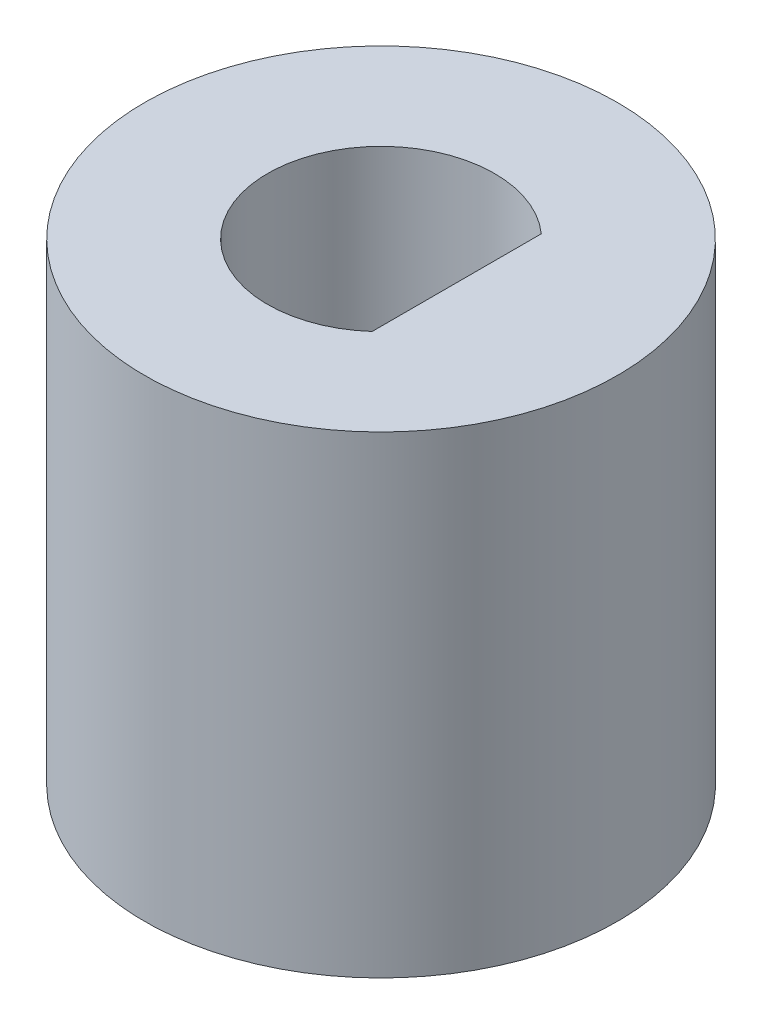
ISO-10303-21;
HEADER;
FILE_DESCRIPTION(('STEP AP214'),'2;1');
FILE_NAME('part.step','',(''),(''),'','','');
FILE_SCHEMA(('AUTOMOTIVE_DESIGN { 1 0 10303 214 1 1 1 1 }'));
ENDSEC;
DATA;
#1=APPLICATION_CONTEXT('core data for automotive mechanical design processes');
#2=APPLICATION_PROTOCOL_DEFINITION('international standard','automotive_design',2000,#1);
#3=PRODUCT_CONTEXT('',#1,'mechanical');
#4=PRODUCT('Part','Part','',(#3));
#5=PRODUCT_RELATED_PRODUCT_CATEGORY('part','',(#4));
#6=PRODUCT_DEFINITION_FORMATION('','',#4);
#7=PRODUCT_DEFINITION_CONTEXT('part definition',#1,'design');
#8=PRODUCT_DEFINITION('design','',#6,#7);
#9=PRODUCT_DEFINITION_SHAPE('','',#8);
#10=(LENGTH_UNIT() NAMED_UNIT(*) SI_UNIT(.MILLI.,.METRE.));
#11=(NAMED_UNIT(*) PLANE_ANGLE_UNIT() SI_UNIT($,.RADIAN.));
#12=(NAMED_UNIT(*) SI_UNIT($,.STERADIAN.) SOLID_ANGLE_UNIT());
#13=UNCERTAINTY_MEASURE_WITH_UNIT(LENGTH_MEASURE(1.E-05),#10,'distance_accuracy_value','');
#14=(GEOMETRIC_REPRESENTATION_CONTEXT(3) GLOBAL_UNCERTAINTY_ASSIGNED_CONTEXT((#13)) GLOBAL_UNIT_ASSIGNED_CONTEXT((#10,
#11,#12)) REPRESENTATION_CONTEXT('',''));
#15=CARTESIAN_POINT('',(0.,0.,0.));
#16=DIRECTION('',(0.,0.,1.));
#17=DIRECTION('',(1.,0.,0.));
#18=AXIS2_PLACEMENT_3D('',#15,#16,#17);
#19=CARTESIAN_POINT('',(0.,0.,0.));
#20=DIRECTION('',(0.,-1.,0.));
#21=DIRECTION('',(0.,0.,-1.));
#22=AXIS2_PLACEMENT_3D('',#19,#20,#21);
#23=CYLINDRICAL_SURFACE('',#22,5.);
#24=CARTESIAN_POINT('',(0.,0.,0.));
#25=DIRECTION('',(0.,-1.,0.));
#26=DIRECTION('',(0.,0.,-1.));
#27=AXIS2_PLACEMENT_3D('',#24,#25,#26);
#28=CIRCLE('',#27,5.);
#29=CARTESIAN_POINT('',(0.,0.,-5.));
#30=VERTEX_POINT('',#29);
#31=EDGE_CURVE('E11',#30,#30,#28,.T.);
#32=ORIENTED_EDGE('',*,*,#31,.F.);
#33=EDGE_LOOP('',(#32));
#34=FACE_BOUND('',#33,.T.);
#35=CARTESIAN_POINT('',(0.,10.,0.));
#36=DIRECTION('',(0.,-1.,0.));
#37=DIRECTION('',(0.,0.,-1.));
#38=AXIS2_PLACEMENT_3D('',#35,#36,#37);
#39=CIRCLE('',#38,5.);
#40=CARTESIAN_POINT('',(0.,10.,-5.));
#41=VERTEX_POINT('',#40);
#42=EDGE_CURVE('E100',#41,#41,#39,.T.);
#43=ORIENTED_EDGE('',*,*,#42,.T.);
#44=EDGE_LOOP('',(#43));
#45=FACE_BOUND('',#44,.T.);
#46=ADVANCED_FACE('F33',(#34,#45),#23,.T.);
#47=CARTESIAN_POINT('',(-5.,0.,0.));
#48=DIRECTION('',(0.,1.,0.));
#49=DIRECTION('',(0.,0.,1.));
#50=AXIS2_PLACEMENT_3D('',#47,#48,#49);
#51=PLANE('',#50);
#52=DIRECTION('',(0.,0.,-1.));
#53=VECTOR('',#52,1.);
#54=CARTESIAN_POINT('',(0.5,0.,-2.77321216722015));
#55=LINE('',#54,#53);
#56=CARTESIAN_POINT('',(0.5,0.,1.93649167310371));
#57=VERTEX_POINT('',#56);
#58=CARTESIAN_POINT('',(0.5,0.,-1.93649167310371));
#59=VERTEX_POINT('',#58);
#60=EDGE_CURVE('E133',#57,#59,#55,.T.);
#61=ORIENTED_EDGE('',*,*,#60,.T.);
#62=CARTESIAN_POINT('',(0.,0.,0.));
#63=DIRECTION('',(0.,-1.,0.));
#64=DIRECTION('',(0.,0.,-1.));
#65=AXIS2_PLACEMENT_3D('',#62,#63,#64);
#66=CIRCLE('',#65,2.);
#67=EDGE_CURVE('E40',#57,#59,#66,.T.);
#68=ORIENTED_EDGE('',*,*,#67,.F.);
#69=EDGE_LOOP('',(#61,#68));
#70=FACE_BOUND('',#69,.T.);
#71=ORIENTED_EDGE('',*,*,#31,.T.);
#72=EDGE_LOOP('',(#71));
#73=FACE_BOUND('',#72,.T.);
#74=ADVANCED_FACE('F117',(#70,#73),#51,.F.);
#75=CARTESIAN_POINT('',(0.,0.,0.));
#76=DIRECTION('',(0.,-1.,0.));
#77=DIRECTION('',(0.,0.,-1.));
#78=AXIS2_PLACEMENT_3D('',#75,#76,#77);
#79=CYLINDRICAL_SURFACE('',#78,2.);
#80=ORIENTED_EDGE('',*,*,#67,.T.);
#81=DIRECTION('',(0.,-1.,0.));
#82=VECTOR('',#81,1.);
#83=CARTESIAN_POINT('',(0.5,0.,-1.93649167310371));
#84=LINE('',#83,#82);
#85=CARTESIAN_POINT('',(0.5,5.,-1.93649167310371));
#86=VERTEX_POINT('',#85);
#87=EDGE_CURVE('E94',#59,#86,#84,.F.);
#88=ORIENTED_EDGE('',*,*,#87,.T.);
#89=CARTESIAN_POINT('',(0.,5.,0.));
#90=DIRECTION('',(0.,1.,0.));
#91=DIRECTION('',(0.,0.,1.));
#92=AXIS2_PLACEMENT_3D('',#89,#90,#91);
#93=CIRCLE('',#92,2.);
#94=CARTESIAN_POINT('',(0.5,5.,1.93649167310371));
#95=VERTEX_POINT('',#94);
#96=EDGE_CURVE('E96',#95,#86,#93,.F.);
#97=ORIENTED_EDGE('',*,*,#96,.F.);
#98=DIRECTION('',(0.,-1.,0.));
#99=VECTOR('',#98,1.);
#100=CARTESIAN_POINT('',(0.5,0.,1.93649167310371));
#101=LINE('',#100,#99);
#102=EDGE_CURVE('E47',#95,#57,#101,.T.);
#103=ORIENTED_EDGE('',*,*,#102,.T.);
#104=EDGE_LOOP('',(#80,#88,#97,#103));
#105=FACE_BOUND('',#104,.T.);
#106=ADVANCED_FACE('F107',(#105),#79,.F.);
#107=CARTESIAN_POINT('',(-1.,10.,0.));
#108=DIRECTION('',(0.,-1.,0.));
#109=DIRECTION('',(0.,0.,-1.));
#110=AXIS2_PLACEMENT_3D('',#107,#108,#109);
#111=PLANE('',#110);
#112=DIRECTION('',(0.,0.,-1.));
#113=VECTOR('',#112,1.);
#114=CARTESIAN_POINT('',(1.6,10.,-1.78885438199983));
#115=LINE('',#114,#113);
#116=CARTESIAN_POINT('',(1.6,10.,1.78885438199983));
#117=VERTEX_POINT('',#116);
#118=CARTESIAN_POINT('',(1.6,10.,-1.78885438199983));
#119=VERTEX_POINT('',#118);
#120=EDGE_CURVE('E77',#117,#119,#115,.T.);
#121=ORIENTED_EDGE('',*,*,#120,.F.);
#122=CARTESIAN_POINT('',(0.,10.,0.));
#123=DIRECTION('',(0.,1.,0.));
#124=DIRECTION('',(0.,0.,1.));
#125=AXIS2_PLACEMENT_3D('',#122,#123,#124);
#126=CIRCLE('',#125,2.4);
#127=EDGE_CURVE('E83',#119,#117,#126,.T.);
#128=ORIENTED_EDGE('',*,*,#127,.F.);
#129=EDGE_LOOP('',(#121,#128));
#130=FACE_BOUND('',#129,.T.);
#131=ORIENTED_EDGE('',*,*,#42,.F.);
#132=EDGE_LOOP('',(#131));
#133=FACE_BOUND('',#132,.T.);
#134=ADVANCED_FACE('F105',(#130,#133),#111,.F.);
#135=CARTESIAN_POINT('',(0.,5.,0.));
#136=DIRECTION('',(0.,1.,0.));
#137=DIRECTION('',(0.,0.,1.));
#138=AXIS2_PLACEMENT_3D('',#135,#136,#137);
#139=PLANE('',#138);
#140=DIRECTION('',(0.,0.,-1.));
#141=VECTOR('',#140,1.);
#142=CARTESIAN_POINT('',(1.6,5.,-1.78885438199983));
#143=LINE('',#142,#141);
#144=CARTESIAN_POINT('',(1.6,5.,1.78885438199983));
#145=VERTEX_POINT('',#144);
#146=CARTESIAN_POINT('',(1.6,5.,-1.78885438199983));
#147=VERTEX_POINT('',#146);
#148=EDGE_CURVE('E74',#145,#147,#143,.T.);
#149=ORIENTED_EDGE('',*,*,#148,.T.);
#150=CARTESIAN_POINT('',(0.,5.,0.));
#151=DIRECTION('',(0.,1.,0.));
#152=DIRECTION('',(0.,0.,1.));
#153=AXIS2_PLACEMENT_3D('',#150,#151,#152);
#154=CIRCLE('',#153,2.4);
#155=EDGE_CURVE('E69',#147,#145,#154,.T.);
#156=ORIENTED_EDGE('',*,*,#155,.T.);
#157=EDGE_LOOP('',(#149,#156));
#158=FACE_BOUND('',#157,.T.);
#159=ORIENTED_EDGE('',*,*,#96,.T.);
#160=DIRECTION('',(0.,0.,-1.));
#161=VECTOR('',#160,1.);
#162=CARTESIAN_POINT('',(0.5,5.,-2.77321216722015));
#163=LINE('',#162,#161);
#164=EDGE_CURVE('E135',#95,#86,#163,.T.);
#165=ORIENTED_EDGE('',*,*,#164,.F.);
#166=EDGE_LOOP('',(#159,#165));
#167=FACE_BOUND('',#166,.T.);
#168=ADVANCED_FACE('F71',(#158,#167),#139,.T.);
#169=CARTESIAN_POINT('',(0.,5.,0.));
#170=DIRECTION('',(0.,1.,0.));
#171=DIRECTION('',(0.,0.,1.));
#172=AXIS2_PLACEMENT_3D('',#169,#170,#171);
#173=CYLINDRICAL_SURFACE('',#172,2.4);
#174=ORIENTED_EDGE('',*,*,#127,.T.);
#175=DIRECTION('',(0.,1.,0.));
#176=VECTOR('',#175,1.);
#177=CARTESIAN_POINT('',(1.6,5.,1.78885438199983));
#178=LINE('',#177,#176);
#179=EDGE_CURVE('E80',#145,#117,#178,.T.);
#180=ORIENTED_EDGE('',*,*,#179,.F.);
#181=ORIENTED_EDGE('',*,*,#155,.F.);
#182=DIRECTION('',(0.,1.,0.));
#183=VECTOR('',#182,1.);
#184=CARTESIAN_POINT('',(1.6,5.,-1.78885438199983));
#185=LINE('',#184,#183);
#186=EDGE_CURVE('E87',#147,#119,#185,.T.);
#187=ORIENTED_EDGE('',*,*,#186,.T.);
#188=EDGE_LOOP('',(#174,#180,#181,#187));
#189=FACE_BOUND('',#188,.T.);
#190=ADVANCED_FACE('F81',(#189),#173,.F.);
#191=CARTESIAN_POINT('',(1.6,5.,-1.78885438199983));
#192=DIRECTION('',(1.,0.,0.));
#193=DIRECTION('',(0.,0.,-1.));
#194=AXIS2_PLACEMENT_3D('',#191,#192,#193);
#195=PLANE('',#194);
#196=ORIENTED_EDGE('',*,*,#120,.T.);
#197=ORIENTED_EDGE('',*,*,#186,.F.);
#198=ORIENTED_EDGE('',*,*,#148,.F.);
#199=ORIENTED_EDGE('',*,*,#179,.T.);
#200=EDGE_LOOP('',(#196,#197,#198,#199));
#201=FACE_BOUND('',#200,.T.);
#202=ADVANCED_FACE('F89',(#201),#195,.F.);
#203=CARTESIAN_POINT('',(0.5,5.,-2.77321216722015));
#204=DIRECTION('',(-1.,0.,0.));
#205=DIRECTION('',(0.,0.,1.));
#206=AXIS2_PLACEMENT_3D('',#203,#204,#205);
#207=PLANE('',#206);
#208=ORIENTED_EDGE('',*,*,#87,.F.);
#209=ORIENTED_EDGE('',*,*,#60,.F.);
#210=ORIENTED_EDGE('',*,*,#102,.F.);
#211=ORIENTED_EDGE('',*,*,#164,.T.);
#212=EDGE_LOOP('',(#208,#209,#210,#211));
#213=FACE_BOUND('',#212,.T.);
#214=ADVANCED_FACE('F141',(#213),#207,.T.);
#215=CLOSED_SHELL('',(#46,#74,#106,#134,#168,#190,#202,#214));
#216=MANIFOLD_SOLID_BREP('B2',#215);
#217=ADVANCED_BREP_SHAPE_REPRESENTATION('',(#18,#216),#14);
#218=SHAPE_DEFINITION_REPRESENTATION(#9,#217);
ENDSEC;
END-ISO-10303-21;
